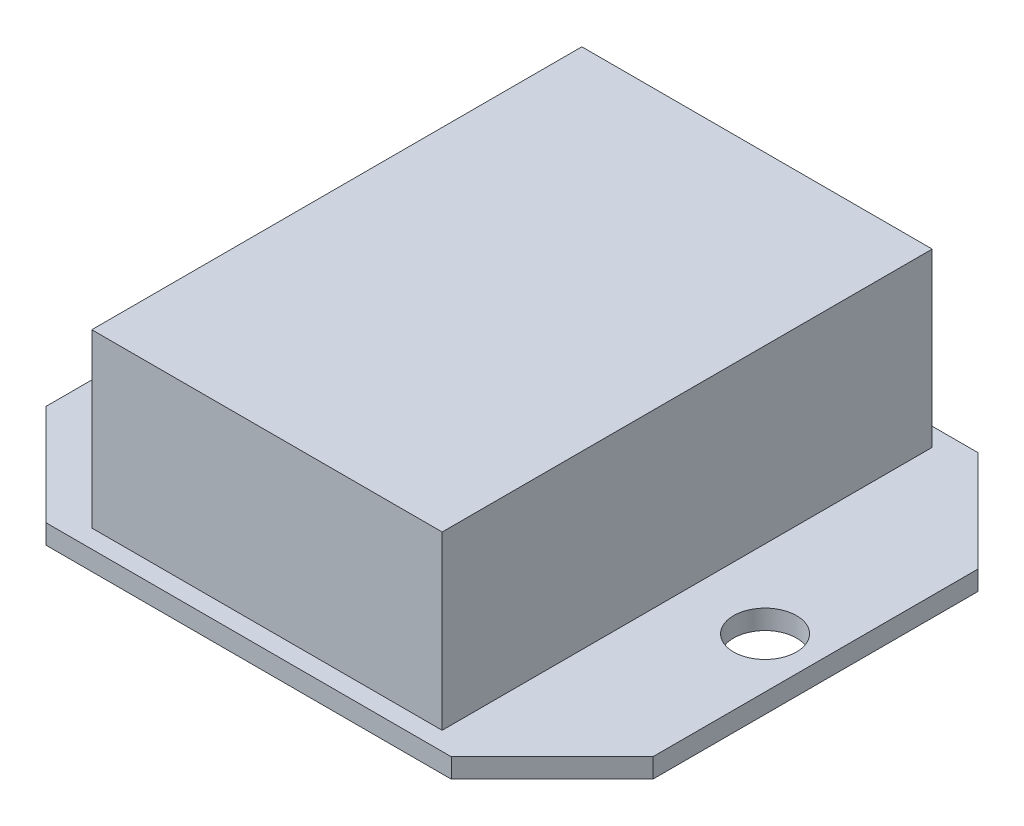
ISO-10303-21;
HEADER;
FILE_DESCRIPTION(('STEP AP214'),'2;1');
FILE_NAME('part.step','',(''),(''),'','','');
FILE_SCHEMA(('AUTOMOTIVE_DESIGN { 1 0 10303 214 1 1 1 1 }'));
ENDSEC;
DATA;
#1=APPLICATION_CONTEXT('core data for automotive mechanical design processes');
#2=APPLICATION_PROTOCOL_DEFINITION('international standard','automotive_design',2000,#1);
#3=PRODUCT_CONTEXT('',#1,'mechanical');
#4=PRODUCT('Part','Part','',(#3));
#5=PRODUCT_RELATED_PRODUCT_CATEGORY('part','',(#4));
#6=PRODUCT_DEFINITION_FORMATION('','',#4);
#7=PRODUCT_DEFINITION_CONTEXT('part definition',#1,'design');
#8=PRODUCT_DEFINITION('design','',#6,#7);
#9=PRODUCT_DEFINITION_SHAPE('','',#8);
#10=(LENGTH_UNIT() NAMED_UNIT(*) SI_UNIT(.MILLI.,.METRE.));
#11=(NAMED_UNIT(*) PLANE_ANGLE_UNIT() SI_UNIT($,.RADIAN.));
#12=(NAMED_UNIT(*) SI_UNIT($,.STERADIAN.) SOLID_ANGLE_UNIT());
#13=UNCERTAINTY_MEASURE_WITH_UNIT(LENGTH_MEASURE(1.E-05),#10,'distance_accuracy_value','');
#14=(GEOMETRIC_REPRESENTATION_CONTEXT(3) GLOBAL_UNCERTAINTY_ASSIGNED_CONTEXT((#13)) GLOBAL_UNIT_ASSIGNED_CONTEXT((#10,
#11,#12)) REPRESENTATION_CONTEXT('',''));
#15=CARTESIAN_POINT('',(0.,0.,0.));
#16=DIRECTION('',(0.,0.,1.));
#17=DIRECTION('',(1.,0.,0.));
#18=AXIS2_PLACEMENT_3D('',#15,#16,#17);
#19=CARTESIAN_POINT('',(33.655,2.159,-29.21));
#20=DIRECTION('',(-1.,0.,0.));
#21=DIRECTION('',(0.,0.,1.));
#22=AXIS2_PLACEMENT_3D('',#19,#20,#21);
#23=PLANE('',#22);
#24=DIRECTION('',(0.,0.,-1.));
#25=VECTOR('',#24,1.);
#26=CARTESIAN_POINT('',(33.655,0.,-29.21));
#27=LINE('',#26,#25);
#28=CARTESIAN_POINT('',(33.655,0.,18.034));
#29=VERTEX_POINT('',#28);
#30=CARTESIAN_POINT('',(33.655,0.,-18.034));
#31=VERTEX_POINT('',#30);
#32=EDGE_CURVE('E165',#29,#31,#27,.T.);
#33=ORIENTED_EDGE('',*,*,#32,.T.);
#34=DIRECTION('',(0.,1.,0.));
#35=VECTOR('',#34,1.);
#36=CARTESIAN_POINT('',(33.655,2.159,-18.034));
#37=LINE('',#36,#35);
#38=CARTESIAN_POINT('',(33.655,2.159,-18.034));
#39=VERTEX_POINT('',#38);
#40=EDGE_CURVE('E11',#31,#39,#37,.T.);
#41=ORIENTED_EDGE('',*,*,#40,.T.);
#42=DIRECTION('',(0.,0.,-1.));
#43=VECTOR('',#42,1.);
#44=CARTESIAN_POINT('',(33.655,2.159,-29.21));
#45=LINE('',#44,#43);
#46=CARTESIAN_POINT('',(33.655,2.159,18.034));
#47=VERTEX_POINT('',#46);
#48=EDGE_CURVE('E176',#47,#39,#45,.T.);
#49=ORIENTED_EDGE('',*,*,#48,.F.);
#50=DIRECTION('',(0.,-1.,0.));
#51=VECTOR('',#50,1.);
#52=CARTESIAN_POINT('',(33.655,2.159,18.034));
#53=LINE('',#52,#51);
#54=EDGE_CURVE('E55',#47,#29,#53,.T.);
#55=ORIENTED_EDGE('',*,*,#54,.T.);
#56=EDGE_LOOP('',(#33,#41,#49,#55));
#57=FACE_BOUND('',#56,.T.);
#58=ADVANCED_FACE('F45',(#57),#23,.F.);
#59=CARTESIAN_POINT('',(-33.655,2.159,-29.21));
#60=DIRECTION('',(0.,0.,1.));
#61=DIRECTION('',(1.,0.,0.));
#62=AXIS2_PLACEMENT_3D('',#59,#60,#61);
#63=PLANE('',#62);
#64=DIRECTION('',(-1.,0.,0.));
#65=VECTOR('',#64,1.);
#66=CARTESIAN_POINT('',(-33.655,0.,-29.21));
#67=LINE('',#66,#65);
#68=CARTESIAN_POINT('',(22.479,0.,-29.21));
#69=VERTEX_POINT('',#68);
#70=CARTESIAN_POINT('',(-22.479,0.,-29.21));
#71=VERTEX_POINT('',#70);
#72=EDGE_CURVE('E170',#69,#71,#67,.T.);
#73=ORIENTED_EDGE('',*,*,#72,.T.);
#74=DIRECTION('',(0.,1.,0.));
#75=VECTOR('',#74,1.);
#76=CARTESIAN_POINT('',(-22.479,2.159,-29.21));
#77=LINE('',#76,#75);
#78=CARTESIAN_POINT('',(-22.479,2.159,-29.21));
#79=VERTEX_POINT('',#78);
#80=EDGE_CURVE('E62',#71,#79,#77,.T.);
#81=ORIENTED_EDGE('',*,*,#80,.T.);
#82=DIRECTION('',(-1.,0.,0.));
#83=VECTOR('',#82,1.);
#84=CARTESIAN_POINT('',(-33.655,2.159,-29.21));
#85=LINE('',#84,#83);
#86=CARTESIAN_POINT('',(22.479,2.159,-29.21));
#87=VERTEX_POINT('',#86);
#88=EDGE_CURVE('E179',#87,#79,#85,.T.);
#89=ORIENTED_EDGE('',*,*,#88,.F.);
#90=DIRECTION('',(0.,-1.,0.));
#91=VECTOR('',#90,1.);
#92=CARTESIAN_POINT('',(22.479,2.159,-29.21));
#93=LINE('',#92,#91);
#94=EDGE_CURVE('E237',#87,#69,#93,.T.);
#95=ORIENTED_EDGE('',*,*,#94,.T.);
#96=EDGE_LOOP('',(#73,#81,#89,#95));
#97=FACE_BOUND('',#96,.T.);
#98=ADVANCED_FACE('F258',(#97),#63,.F.);
#99=CARTESIAN_POINT('',(-33.655,2.159,-29.21));
#100=DIRECTION('',(1.,0.,0.));
#101=DIRECTION('',(0.,0.,-1.));
#102=AXIS2_PLACEMENT_3D('',#99,#100,#101);
#103=PLANE('',#102);
#104=DIRECTION('',(0.,0.,1.));
#105=VECTOR('',#104,1.);
#106=CARTESIAN_POINT('',(-33.655,0.,-29.21));
#107=LINE('',#106,#105);
#108=CARTESIAN_POINT('',(-33.655,0.,-18.034));
#109=VERTEX_POINT('',#108);
#110=CARTESIAN_POINT('',(-33.655,0.,18.034));
#111=VERTEX_POINT('',#110);
#112=EDGE_CURVE('E194',#109,#111,#107,.T.);
#113=ORIENTED_EDGE('',*,*,#112,.T.);
#114=DIRECTION('',(0.,1.,0.));
#115=VECTOR('',#114,1.);
#116=CARTESIAN_POINT('',(-33.655,2.159,18.034));
#117=LINE('',#116,#115);
#118=CARTESIAN_POINT('',(-33.655,2.159,18.034));
#119=VERTEX_POINT('',#118);
#120=EDGE_CURVE('E223',#111,#119,#117,.T.);
#121=ORIENTED_EDGE('',*,*,#120,.T.);
#122=DIRECTION('',(0.,0.,1.));
#123=VECTOR('',#122,1.);
#124=CARTESIAN_POINT('',(-33.655,2.159,-29.21));
#125=LINE('',#124,#123);
#126=CARTESIAN_POINT('',(-33.655,2.159,-18.034));
#127=VERTEX_POINT('',#126);
#128=EDGE_CURVE('E183',#127,#119,#125,.T.);
#129=ORIENTED_EDGE('',*,*,#128,.F.);
#130=DIRECTION('',(0.,-1.,0.));
#131=VECTOR('',#130,1.);
#132=CARTESIAN_POINT('',(-33.655,2.159,-18.034));
#133=LINE('',#132,#131);
#134=EDGE_CURVE('E219',#127,#109,#133,.T.);
#135=ORIENTED_EDGE('',*,*,#134,.T.);
#136=EDGE_LOOP('',(#113,#121,#129,#135));
#137=FACE_BOUND('',#136,.T.);
#138=ADVANCED_FACE('F267',(#137),#103,.F.);
#139=CARTESIAN_POINT('',(-33.655,2.159,29.21));
#140=DIRECTION('',(0.,0.,-1.));
#141=DIRECTION('',(-1.,0.,0.));
#142=AXIS2_PLACEMENT_3D('',#139,#140,#141);
#143=PLANE('',#142);
#144=DIRECTION('',(1.,0.,0.));
#145=VECTOR('',#144,1.);
#146=CARTESIAN_POINT('',(-33.655,2.159,29.21));
#147=LINE('',#146,#145);
#148=CARTESIAN_POINT('',(-22.479,2.159,29.21));
#149=VERTEX_POINT('',#148);
#150=CARTESIAN_POINT('',(22.479,2.159,29.21));
#151=VERTEX_POINT('',#150);
#152=EDGE_CURVE('E187',#149,#151,#147,.T.);
#153=ORIENTED_EDGE('',*,*,#152,.F.);
#154=DIRECTION('',(0.,-1.,0.));
#155=VECTOR('',#154,1.);
#156=CARTESIAN_POINT('',(-22.479,2.159,29.21));
#157=LINE('',#156,#155);
#158=CARTESIAN_POINT('',(-22.479,0.,29.21));
#159=VERTEX_POINT('',#158);
#160=EDGE_CURVE('E203',#149,#159,#157,.T.);
#161=ORIENTED_EDGE('',*,*,#160,.T.);
#162=DIRECTION('',(1.,0.,0.));
#163=VECTOR('',#162,1.);
#164=CARTESIAN_POINT('',(-33.655,0.,29.21));
#165=LINE('',#164,#163);
#166=CARTESIAN_POINT('',(22.479,0.,29.21));
#167=VERTEX_POINT('',#166);
#168=EDGE_CURVE('E180',#159,#167,#165,.T.);
#169=ORIENTED_EDGE('',*,*,#168,.T.);
#170=DIRECTION('',(0.,1.,0.));
#171=VECTOR('',#170,1.);
#172=CARTESIAN_POINT('',(22.479,2.159,29.21));
#173=LINE('',#172,#171);
#174=EDGE_CURVE('E190',#167,#151,#173,.T.);
#175=ORIENTED_EDGE('',*,*,#174,.T.);
#176=EDGE_LOOP('',(#153,#161,#169,#175));
#177=FACE_BOUND('',#176,.T.);
#178=ADVANCED_FACE('F275',(#177),#143,.F.);
#179=CARTESIAN_POINT('',(0.,2.159,0.));
#180=DIRECTION('',(0.,1.,0.));
#181=DIRECTION('',(0.,0.,1.));
#182=AXIS2_PLACEMENT_3D('',#179,#180,#181);
#183=PLANE('',#182);
#184=CARTESIAN_POINT('',(-28.067,2.159,0.));
#185=DIRECTION('',(0.,1.,0.));
#186=DIRECTION('',(0.,0.,1.));
#187=AXIS2_PLACEMENT_3D('',#184,#185,#186);
#188=CIRCLE('',#187,3.4925);
#189=CARTESIAN_POINT('',(-28.067,2.159,3.4925));
#190=VERTEX_POINT('',#189);
#191=EDGE_CURVE('E469',#190,#190,#188,.T.);
#192=ORIENTED_EDGE('',*,*,#191,.F.);
#193=EDGE_LOOP('',(#192));
#194=FACE_BOUND('',#193,.T.);
#195=CARTESIAN_POINT('',(28.067,2.159,0.));
#196=DIRECTION('',(0.,1.,0.));
#197=DIRECTION('',(0.,0.,1.));
#198=AXIS2_PLACEMENT_3D('',#195,#196,#197);
#199=CIRCLE('',#198,3.4925);
#200=CARTESIAN_POINT('',(28.067,2.159,3.4925));
#201=VERTEX_POINT('',#200);
#202=EDGE_CURVE('E473',#201,#201,#199,.T.);
#203=ORIENTED_EDGE('',*,*,#202,.F.);
#204=EDGE_LOOP('',(#203));
#205=FACE_BOUND('',#204,.T.);
#206=DIRECTION('',(0.,0.,-1.));
#207=VECTOR('',#206,1.);
#208=CARTESIAN_POINT('',(19.431,2.159,-27.178));
#209=LINE('',#208,#207);
#210=CARTESIAN_POINT('',(19.431,2.159,27.178));
#211=VERTEX_POINT('',#210);
#212=CARTESIAN_POINT('',(19.431,2.159,-27.178));
#213=VERTEX_POINT('',#212);
#214=EDGE_CURVE('E163',#211,#213,#209,.T.);
#215=ORIENTED_EDGE('',*,*,#214,.F.);
#216=DIRECTION('',(1.,0.,0.));
#217=VECTOR('',#216,1.);
#218=CARTESIAN_POINT('',(-19.431,2.159,27.178));
#219=LINE('',#218,#217);
#220=CARTESIAN_POINT('',(-19.431,2.159,27.178));
#221=VERTEX_POINT('',#220);
#222=EDGE_CURVE('E160',#221,#211,#219,.T.);
#223=ORIENTED_EDGE('',*,*,#222,.F.);
#224=DIRECTION('',(0.,0.,1.));
#225=VECTOR('',#224,1.);
#226=CARTESIAN_POINT('',(-19.431,2.159,-27.178));
#227=LINE('',#226,#225);
#228=CARTESIAN_POINT('',(-19.431,2.159,-27.178));
#229=VERTEX_POINT('',#228);
#230=EDGE_CURVE('E484',#229,#221,#227,.T.);
#231=ORIENTED_EDGE('',*,*,#230,.F.);
#232=DIRECTION('',(-1.,0.,0.));
#233=VECTOR('',#232,1.);
#234=CARTESIAN_POINT('',(-19.431,2.159,-27.178));
#235=LINE('',#234,#233);
#236=EDGE_CURVE('E476',#213,#229,#235,.T.);
#237=ORIENTED_EDGE('',*,*,#236,.F.);
#238=EDGE_LOOP('',(#215,#223,#231,#237));
#239=FACE_BOUND('',#238,.T.);
#240=ORIENTED_EDGE('',*,*,#128,.T.);
#241=DIRECTION('',(-0.707106781186547,0.,-0.707106781186549));
#242=VECTOR('',#241,1.);
#243=CARTESIAN_POINT('',(-25.8445,2.159,25.8445));
#244=LINE('',#243,#242);
#245=EDGE_CURVE('E234',#119,#149,#244,.F.);
#246=ORIENTED_EDGE('',*,*,#245,.T.);
#247=ORIENTED_EDGE('',*,*,#152,.T.);
#248=DIRECTION('',(-0.707106781186549,0.,0.707106781186546));
#249=VECTOR('',#248,1.);
#250=CARTESIAN_POINT('',(25.8444999999999,2.159,25.8445));
#251=LINE('',#250,#249);
#252=EDGE_CURVE('E226',#151,#47,#251,.F.);
#253=ORIENTED_EDGE('',*,*,#252,.T.);
#254=ORIENTED_EDGE('',*,*,#48,.T.);
#255=DIRECTION('',(0.707106781186547,0.,0.707106781186548));
#256=VECTOR('',#255,1.);
#257=CARTESIAN_POINT('',(25.8445,2.159,-25.8445));
#258=LINE('',#257,#256);
#259=EDGE_CURVE('E69',#39,#87,#258,.F.);
#260=ORIENTED_EDGE('',*,*,#259,.T.);
#261=ORIENTED_EDGE('',*,*,#88,.T.);
#262=DIRECTION('',(0.707106781186549,0.,-0.707106781186547));
#263=VECTOR('',#262,1.);
#264=CARTESIAN_POINT('',(-25.8445,2.159,-25.8445));
#265=LINE('',#264,#263);
#266=EDGE_CURVE('E231',#79,#127,#265,.F.);
#267=ORIENTED_EDGE('',*,*,#266,.T.);
#268=EDGE_LOOP('',(#240,#246,#247,#253,#254,#260,#261,#267));
#269=FACE_BOUND('',#268,.T.);
#270=ADVANCED_FACE('F260',(#194,#205,#239,#269),#183,.T.);
#271=CARTESIAN_POINT('',(0.,0.,0.));
#272=DIRECTION('',(0.,1.,0.));
#273=DIRECTION('',(0.,0.,1.));
#274=AXIS2_PLACEMENT_3D('',#271,#272,#273);
#275=PLANE('',#274);
#276=CARTESIAN_POINT('',(-28.067,0.,0.));
#277=DIRECTION('',(0.,1.,0.));
#278=DIRECTION('',(0.,0.,1.));
#279=AXIS2_PLACEMENT_3D('',#276,#277,#278);
#280=CIRCLE('',#279,3.4925);
#281=CARTESIAN_POINT('',(-28.067,0.,3.4925));
#282=VERTEX_POINT('',#281);
#283=EDGE_CURVE('E503',#282,#282,#280,.T.);
#284=ORIENTED_EDGE('',*,*,#283,.T.);
#285=EDGE_LOOP('',(#284));
#286=FACE_BOUND('',#285,.T.);
#287=CARTESIAN_POINT('',(28.067,0.,0.));
#288=DIRECTION('',(0.,1.,0.));
#289=DIRECTION('',(0.,0.,1.));
#290=AXIS2_PLACEMENT_3D('',#287,#288,#289);
#291=CIRCLE('',#290,3.4925);
#292=CARTESIAN_POINT('',(28.067,0.,3.4925));
#293=VERTEX_POINT('',#292);
#294=EDGE_CURVE('E478',#293,#293,#291,.T.);
#295=ORIENTED_EDGE('',*,*,#294,.T.);
#296=EDGE_LOOP('',(#295));
#297=FACE_BOUND('',#296,.T.);
#298=ORIENTED_EDGE('',*,*,#168,.F.);
#299=DIRECTION('',(0.707106781186547,0.,0.707106781186549));
#300=VECTOR('',#299,1.);
#301=CARTESIAN_POINT('',(-22.479,0.,29.21));
#302=LINE('',#301,#300);
#303=EDGE_CURVE('E216',#159,#111,#302,.F.);
#304=ORIENTED_EDGE('',*,*,#303,.T.);
#305=ORIENTED_EDGE('',*,*,#112,.F.);
#306=DIRECTION('',(-0.707106781186549,0.,0.707106781186547));
#307=VECTOR('',#306,1.);
#308=CARTESIAN_POINT('',(-33.655,0.,-18.034));
#309=LINE('',#308,#307);
#310=EDGE_CURVE('E213',#109,#71,#309,.F.);
#311=ORIENTED_EDGE('',*,*,#310,.T.);
#312=ORIENTED_EDGE('',*,*,#72,.F.);
#313=DIRECTION('',(-0.707106781186547,0.,-0.707106781186548));
#314=VECTOR('',#313,1.);
#315=CARTESIAN_POINT('',(22.479,0.,-29.21));
#316=LINE('',#315,#314);
#317=EDGE_CURVE('E210',#69,#31,#316,.F.);
#318=ORIENTED_EDGE('',*,*,#317,.T.);
#319=ORIENTED_EDGE('',*,*,#32,.F.);
#320=DIRECTION('',(0.707106781186549,0.,-0.707106781186546));
#321=VECTOR('',#320,1.);
#322=CARTESIAN_POINT('',(33.655,0.,18.034));
#323=LINE('',#322,#321);
#324=EDGE_CURVE('E207',#29,#167,#323,.F.);
#325=ORIENTED_EDGE('',*,*,#324,.T.);
#326=EDGE_LOOP('',(#298,#304,#305,#311,#312,#318,#319,#325));
#327=FACE_BOUND('',#326,.T.);
#328=ADVANCED_FACE('F253',(#286,#297,#327),#275,.F.);
#329=CARTESIAN_POINT('',(19.431,21.209,-27.178));
#330=DIRECTION('',(-1.,0.,0.));
#331=DIRECTION('',(0.,0.,1.));
#332=AXIS2_PLACEMENT_3D('',#329,#330,#331);
#333=PLANE('',#332);
#334=ORIENTED_EDGE('',*,*,#214,.T.);
#335=DIRECTION('',(0.,-1.,0.));
#336=VECTOR('',#335,1.);
#337=CARTESIAN_POINT('',(19.431,21.209,-27.178));
#338=LINE('',#337,#336);
#339=CARTESIAN_POINT('',(19.431,21.209,-27.178));
#340=VERTEX_POINT('',#339);
#341=EDGE_CURVE('E142',#340,#213,#338,.T.);
#342=ORIENTED_EDGE('',*,*,#341,.F.);
#343=DIRECTION('',(0.,0.,-1.));
#344=VECTOR('',#343,1.);
#345=CARTESIAN_POINT('',(19.431,21.209,-27.178));
#346=LINE('',#345,#344);
#347=CARTESIAN_POINT('',(19.431,21.209,27.178));
#348=VERTEX_POINT('',#347);
#349=EDGE_CURVE('E150',#348,#340,#346,.T.);
#350=ORIENTED_EDGE('',*,*,#349,.F.);
#351=DIRECTION('',(0.,-1.,0.));
#352=VECTOR('',#351,1.);
#353=CARTESIAN_POINT('',(19.431,21.209,27.178));
#354=LINE('',#353,#352);
#355=EDGE_CURVE('E481',#348,#211,#354,.T.);
#356=ORIENTED_EDGE('',*,*,#355,.T.);
#357=EDGE_LOOP('',(#334,#342,#350,#356));
#358=FACE_BOUND('',#357,.T.);
#359=ADVANCED_FACE('F162',(#358),#333,.F.);
#360=CARTESIAN_POINT('',(-19.431,21.209,-27.178));
#361=DIRECTION('',(0.,0.,1.));
#362=DIRECTION('',(1.,0.,0.));
#363=AXIS2_PLACEMENT_3D('',#360,#361,#362);
#364=PLANE('',#363);
#365=ORIENTED_EDGE('',*,*,#236,.T.);
#366=DIRECTION('',(0.,-1.,0.));
#367=VECTOR('',#366,1.);
#368=CARTESIAN_POINT('',(-19.431,21.209,-27.178));
#369=LINE('',#368,#367);
#370=CARTESIAN_POINT('',(-19.431,21.209,-27.178));
#371=VERTEX_POINT('',#370);
#372=EDGE_CURVE('E145',#371,#229,#369,.T.);
#373=ORIENTED_EDGE('',*,*,#372,.F.);
#374=DIRECTION('',(-1.,0.,0.));
#375=VECTOR('',#374,1.);
#376=CARTESIAN_POINT('',(-19.431,21.209,-27.178));
#377=LINE('',#376,#375);
#378=EDGE_CURVE('E137',#340,#371,#377,.T.);
#379=ORIENTED_EDGE('',*,*,#378,.F.);
#380=ORIENTED_EDGE('',*,*,#341,.T.);
#381=EDGE_LOOP('',(#365,#373,#379,#380));
#382=FACE_BOUND('',#381,.T.);
#383=ADVANCED_FACE('F140',(#382),#364,.F.);
#384=CARTESIAN_POINT('',(-19.431,21.209,-27.178));
#385=DIRECTION('',(1.,0.,0.));
#386=DIRECTION('',(0.,0.,-1.));
#387=AXIS2_PLACEMENT_3D('',#384,#385,#386);
#388=PLANE('',#387);
#389=ORIENTED_EDGE('',*,*,#230,.T.);
#390=DIRECTION('',(0.,-1.,0.));
#391=VECTOR('',#390,1.);
#392=CARTESIAN_POINT('',(-19.431,21.209,27.178));
#393=LINE('',#392,#391);
#394=CARTESIAN_POINT('',(-19.431,21.209,27.178));
#395=VERTEX_POINT('',#394);
#396=EDGE_CURVE('E172',#395,#221,#393,.T.);
#397=ORIENTED_EDGE('',*,*,#396,.F.);
#398=DIRECTION('',(0.,0.,1.));
#399=VECTOR('',#398,1.);
#400=CARTESIAN_POINT('',(-19.431,21.209,-27.178));
#401=LINE('',#400,#399);
#402=EDGE_CURVE('E149',#371,#395,#401,.T.);
#403=ORIENTED_EDGE('',*,*,#402,.F.);
#404=ORIENTED_EDGE('',*,*,#372,.T.);
#405=EDGE_LOOP('',(#389,#397,#403,#404));
#406=FACE_BOUND('',#405,.T.);
#407=ADVANCED_FACE('F366',(#406),#388,.F.);
#408=CARTESIAN_POINT('',(-19.431,21.209,27.178));
#409=DIRECTION('',(0.,0.,-1.));
#410=DIRECTION('',(-1.,0.,0.));
#411=AXIS2_PLACEMENT_3D('',#408,#409,#410);
#412=PLANE('',#411);
#413=ORIENTED_EDGE('',*,*,#222,.T.);
#414=ORIENTED_EDGE('',*,*,#355,.F.);
#415=DIRECTION('',(1.,0.,0.));
#416=VECTOR('',#415,1.);
#417=CARTESIAN_POINT('',(-19.431,21.209,27.178));
#418=LINE('',#417,#416);
#419=EDGE_CURVE('E155',#395,#348,#418,.T.);
#420=ORIENTED_EDGE('',*,*,#419,.F.);
#421=ORIENTED_EDGE('',*,*,#396,.T.);
#422=EDGE_LOOP('',(#413,#414,#420,#421));
#423=FACE_BOUND('',#422,.T.);
#424=ADVANCED_FACE('F357',(#423),#412,.F.);
#425=CARTESIAN_POINT('',(0.,21.209,0.));
#426=DIRECTION('',(0.,1.,0.));
#427=DIRECTION('',(0.,0.,1.));
#428=AXIS2_PLACEMENT_3D('',#425,#426,#427);
#429=PLANE('',#428);
#430=ORIENTED_EDGE('',*,*,#349,.T.);
#431=ORIENTED_EDGE('',*,*,#378,.T.);
#432=ORIENTED_EDGE('',*,*,#402,.T.);
#433=ORIENTED_EDGE('',*,*,#419,.T.);
#434=EDGE_LOOP('',(#430,#431,#432,#433));
#435=FACE_BOUND('',#434,.T.);
#436=ADVANCED_FACE('F153',(#435),#429,.T.);
#437=CARTESIAN_POINT('',(28.067,2.159,0.));
#438=DIRECTION('',(0.,1.,0.));
#439=DIRECTION('',(0.,0.,1.));
#440=AXIS2_PLACEMENT_3D('',#437,#438,#439);
#441=CYLINDRICAL_SURFACE('',#440,3.4925);
#442=ORIENTED_EDGE('',*,*,#202,.T.);
#443=EDGE_LOOP('',(#442));
#444=FACE_BOUND('',#443,.T.);
#445=ORIENTED_EDGE('',*,*,#294,.F.);
#446=EDGE_LOOP('',(#445));
#447=FACE_BOUND('',#446,.T.);
#448=ADVANCED_FACE('F338',(#444,#447),#441,.F.);
#449=CARTESIAN_POINT('',(-28.067,2.159,0.));
#450=DIRECTION('',(0.,1.,0.));
#451=DIRECTION('',(0.,0.,1.));
#452=AXIS2_PLACEMENT_3D('',#449,#450,#451);
#453=CYLINDRICAL_SURFACE('',#452,3.4925);
#454=ORIENTED_EDGE('',*,*,#191,.T.);
#455=EDGE_LOOP('',(#454));
#456=FACE_BOUND('',#455,.T.);
#457=ORIENTED_EDGE('',*,*,#283,.F.);
#458=EDGE_LOOP('',(#457));
#459=FACE_BOUND('',#458,.T.);
#460=ADVANCED_FACE('F295',(#456,#459),#453,.F.);
#461=CARTESIAN_POINT('',(-22.479,2.159,29.21));
#462=DIRECTION('',(0.707106781186548,0.,-0.707106781186546));
#463=DIRECTION('',(0.,-1.,0.));
#464=AXIS2_PLACEMENT_3D('',#461,#462,#463);
#465=PLANE('',#464);
#466=ORIENTED_EDGE('',*,*,#245,.F.);
#467=ORIENTED_EDGE('',*,*,#120,.F.);
#468=ORIENTED_EDGE('',*,*,#303,.F.);
#469=ORIENTED_EDGE('',*,*,#160,.F.);
#470=EDGE_LOOP('',(#466,#467,#468,#469));
#471=FACE_BOUND('',#470,.T.);
#472=ADVANCED_FACE('F272',(#471),#465,.F.);
#473=CARTESIAN_POINT('',(-33.655,2.159,-18.034));
#474=DIRECTION('',(0.707106781186547,0.,0.707106781186549));
#475=DIRECTION('',(0.,-1.,0.));
#476=AXIS2_PLACEMENT_3D('',#473,#474,#475);
#477=PLANE('',#476);
#478=ORIENTED_EDGE('',*,*,#266,.F.);
#479=ORIENTED_EDGE('',*,*,#80,.F.);
#480=ORIENTED_EDGE('',*,*,#310,.F.);
#481=ORIENTED_EDGE('',*,*,#134,.F.);
#482=EDGE_LOOP('',(#478,#479,#480,#481));
#483=FACE_BOUND('',#482,.T.);
#484=ADVANCED_FACE('F264',(#483),#477,.F.);
#485=CARTESIAN_POINT('',(22.479,2.159,-29.21));
#486=DIRECTION('',(-0.707106781186548,0.,0.707106781186547));
#487=DIRECTION('',(0.,-1.,0.));
#488=AXIS2_PLACEMENT_3D('',#485,#486,#487);
#489=PLANE('',#488);
#490=ORIENTED_EDGE('',*,*,#259,.F.);
#491=ORIENTED_EDGE('',*,*,#40,.F.);
#492=ORIENTED_EDGE('',*,*,#317,.F.);
#493=ORIENTED_EDGE('',*,*,#94,.F.);
#494=EDGE_LOOP('',(#490,#491,#492,#493));
#495=FACE_BOUND('',#494,.T.);
#496=ADVANCED_FACE('F257',(#495),#489,.F.);
#497=CARTESIAN_POINT('',(33.655,2.159,18.034));
#498=DIRECTION('',(-0.707106781186546,0.,-0.707106781186549));
#499=DIRECTION('',(0.,-1.,0.));
#500=AXIS2_PLACEMENT_3D('',#497,#498,#499);
#501=PLANE('',#500);
#502=ORIENTED_EDGE('',*,*,#252,.F.);
#503=ORIENTED_EDGE('',*,*,#174,.F.);
#504=ORIENTED_EDGE('',*,*,#324,.F.);
#505=ORIENTED_EDGE('',*,*,#54,.F.);
#506=EDGE_LOOP('',(#502,#503,#504,#505));
#507=FACE_BOUND('',#506,.T.);
#508=ADVANCED_FACE('F48',(#507),#501,.F.);
#509=CLOSED_SHELL('',(#58,#98,#138,#178,#270,#328,#359,#383,#407,#424,#436,#448,#460,#472,#484,
#496,#508));
#510=MANIFOLD_SOLID_BREP('B2',#509);
#511=ADVANCED_BREP_SHAPE_REPRESENTATION('',(#18,#510),#14);
#512=SHAPE_DEFINITION_REPRESENTATION(#9,#511);
ENDSEC;
END-ISO-10303-21;
